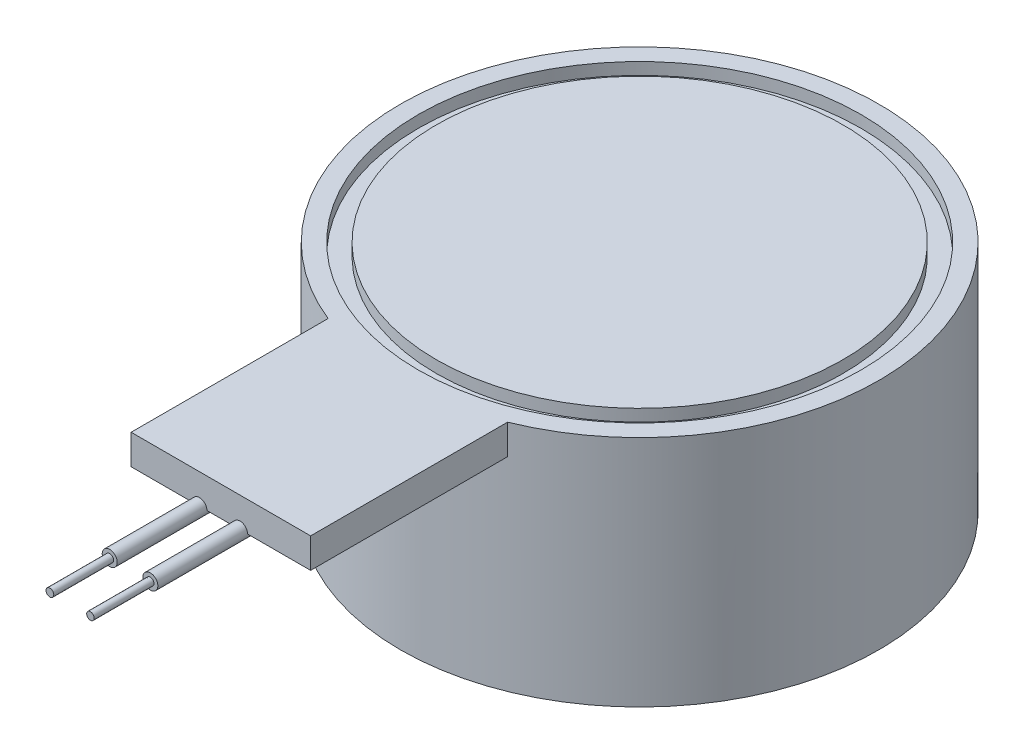
ISO-10303-21;
HEADER;
FILE_DESCRIPTION(('STEP AP214'),'2;1');
FILE_NAME('part.step','',(''),(''),'','','');
FILE_SCHEMA(('AUTOMOTIVE_DESIGN { 1 0 10303 214 1 1 1 1 }'));
ENDSEC;
DATA;
#1=APPLICATION_CONTEXT('core data for automotive mechanical design processes');
#2=APPLICATION_PROTOCOL_DEFINITION('international standard','automotive_design',2000,#1);
#3=PRODUCT_CONTEXT('',#1,'mechanical');
#4=PRODUCT('Part','Part','',(#3));
#5=PRODUCT_RELATED_PRODUCT_CATEGORY('part','',(#4));
#6=PRODUCT_DEFINITION_FORMATION('','',#4);
#7=PRODUCT_DEFINITION_CONTEXT('part definition',#1,'design');
#8=PRODUCT_DEFINITION('design','',#6,#7);
#9=PRODUCT_DEFINITION_SHAPE('','',#8);
#10=(LENGTH_UNIT() NAMED_UNIT(*) SI_UNIT(.MILLI.,.METRE.));
#11=(NAMED_UNIT(*) PLANE_ANGLE_UNIT() SI_UNIT($,.RADIAN.));
#12=(NAMED_UNIT(*) SI_UNIT($,.STERADIAN.) SOLID_ANGLE_UNIT());
#13=UNCERTAINTY_MEASURE_WITH_UNIT(LENGTH_MEASURE(1.E-05),#10,'distance_accuracy_value','');
#14=(GEOMETRIC_REPRESENTATION_CONTEXT(3) GLOBAL_UNCERTAINTY_ASSIGNED_CONTEXT((#13)) GLOBAL_UNIT_ASSIGNED_CONTEXT((#10,
#11,#12)) REPRESENTATION_CONTEXT('',''));
#15=CARTESIAN_POINT('',(0.,0.,0.));
#16=DIRECTION('',(0.,0.,1.));
#17=DIRECTION('',(1.,0.,0.));
#18=AXIS2_PLACEMENT_3D('',#15,#16,#17);
#19=CARTESIAN_POINT('',(2.01299055613309,-3.4,-4.98901514503397));
#20=DIRECTION('',(0.,1.,0.));
#21=DIRECTION('',(0.,0.,1.));
#22=AXIS2_PLACEMENT_3D('',#19,#20,#21);
#23=CYLINDRICAL_SURFACE('',#22,4.);
#24=DIRECTION('',(0.,1.,0.));
#25=VECTOR('',#24,1.);
#26=CARTESIAN_POINT('',(0.512990556133091,0.,-1.28091590148614));
#27=LINE('',#26,#25);
#28=CARTESIAN_POINT('',(0.512990556133091,0.,-1.28091590148614));
#29=VERTEX_POINT('',#28);
#30=CARTESIAN_POINT('',(0.512990556133091,0.5,-1.28091590148614));
#31=VERTEX_POINT('',#30);
#32=EDGE_CURVE('E159',#29,#31,#27,.T.);
#33=ORIENTED_EDGE('',*,*,#32,.T.);
#34=CARTESIAN_POINT('',(2.01299055613309,0.5,-4.98901514503397));
#35=DIRECTION('',(0.,1.,0.));
#36=DIRECTION('',(0.,0.,1.));
#37=AXIS2_PLACEMENT_3D('',#34,#35,#36);
#38=CIRCLE('',#37,4.);
#39=CARTESIAN_POINT('',(3.51299055613309,0.5,-1.28091590148614));
#40=VERTEX_POINT('',#39);
#41=EDGE_CURVE('E158',#40,#31,#38,.T.);
#42=ORIENTED_EDGE('',*,*,#41,.F.);
#43=DIRECTION('',(0.,1.,0.));
#44=VECTOR('',#43,1.);
#45=CARTESIAN_POINT('',(3.51299055613309,0.,-1.28091590148614));
#46=LINE('',#45,#44);
#47=CARTESIAN_POINT('',(3.51299055613309,0.,-1.28091590148614));
#48=VERTEX_POINT('',#47);
#49=EDGE_CURVE('E162',#48,#40,#46,.T.);
#50=ORIENTED_EDGE('',*,*,#49,.F.);
#51=CARTESIAN_POINT('',(2.01299055613309,0.,-4.98901514503397));
#52=DIRECTION('',(0.,1.,0.));
#53=DIRECTION('',(0.,0.,1.));
#54=AXIS2_PLACEMENT_3D('',#51,#52,#53);
#55=CIRCLE('',#54,4.);
#56=EDGE_CURVE('E143',#29,#48,#55,.T.);
#57=ORIENTED_EDGE('',*,*,#56,.F.);
#58=EDGE_LOOP('',(#33,#42,#50,#57));
#59=FACE_BOUND('',#58,.T.);
#60=CARTESIAN_POINT('',(2.01299055613309,-3.4,-4.98901514503397));
#61=DIRECTION('',(0.,1.,0.));
#62=DIRECTION('',(0.,0.,1.));
#63=AXIS2_PLACEMENT_3D('',#60,#61,#62);
#64=CIRCLE('',#63,4.);
#65=CARTESIAN_POINT('',(2.01299055613309,-3.4,-0.989015145033973));
#66=VERTEX_POINT('',#65);
#67=EDGE_CURVE('E168',#66,#66,#64,.T.);
#68=ORIENTED_EDGE('',*,*,#67,.T.);
#69=EDGE_LOOP('',(#68));
#70=FACE_BOUND('',#69,.T.);
#71=ADVANCED_FACE('F38',(#59,#70),#23,.T.);
#72=CARTESIAN_POINT('',(2.01299055613309,-3.4,-4.98901514503397));
#73=DIRECTION('',(0.,1.,0.));
#74=DIRECTION('',(0.,0.,1.));
#75=AXIS2_PLACEMENT_3D('',#72,#73,#74);
#76=PLANE('',#75);
#77=ORIENTED_EDGE('',*,*,#67,.F.);
#78=EDGE_LOOP('',(#77));
#79=FACE_BOUND('',#78,.T.);
#80=ADVANCED_FACE('F195',(#79),#76,.F.);
#81=CARTESIAN_POINT('',(2.01299055613309,0.5,-4.98901514503397));
#82=DIRECTION('',(0.,1.,0.));
#83=DIRECTION('',(0.,0.,1.));
#84=AXIS2_PLACEMENT_3D('',#81,#82,#83);
#85=PLANE('',#84);
#86=CARTESIAN_POINT('',(2.01299055613309,0.5,-4.98901514503397));
#87=DIRECTION('',(0.,1.,0.));
#88=DIRECTION('',(0.,0.,1.));
#89=AXIS2_PLACEMENT_3D('',#86,#87,#88);
#90=CIRCLE('',#89,3.7);
#91=CARTESIAN_POINT('',(2.01299055613309,0.5,-1.28901514503397));
#92=VERTEX_POINT('',#91);
#93=EDGE_CURVE('E276',#92,#92,#90,.T.);
#94=ORIENTED_EDGE('',*,*,#93,.F.);
#95=EDGE_LOOP('',(#94));
#96=FACE_BOUND('',#95,.T.);
#97=ORIENTED_EDGE('',*,*,#41,.T.);
#98=DIRECTION('',(0.,0.,1.));
#99=VECTOR('',#98,1.);
#100=CARTESIAN_POINT('',(0.512990556133091,0.5,0.));
#101=LINE('',#100,#99);
#102=CARTESIAN_POINT('',(0.512990556133091,0.5,2.01098485496603));
#103=VERTEX_POINT('',#102);
#104=EDGE_CURVE('E153',#31,#103,#101,.T.);
#105=ORIENTED_EDGE('',*,*,#104,.T.);
#106=DIRECTION('',(1.,0.,0.));
#107=VECTOR('',#106,1.);
#108=CARTESIAN_POINT('',(0.,0.5,2.01098485496603));
#109=LINE('',#108,#107);
#110=CARTESIAN_POINT('',(3.51299055613309,0.5,2.01098485496603));
#111=VERTEX_POINT('',#110);
#112=EDGE_CURVE('E134',#103,#111,#109,.T.);
#113=ORIENTED_EDGE('',*,*,#112,.T.);
#114=DIRECTION('',(0.,0.,-1.));
#115=VECTOR('',#114,1.);
#116=CARTESIAN_POINT('',(3.51299055613309,0.5,0.));
#117=LINE('',#116,#115);
#118=EDGE_CURVE('E151',#111,#40,#117,.T.);
#119=ORIENTED_EDGE('',*,*,#118,.T.);
#120=EDGE_LOOP('',(#97,#105,#113,#119));
#121=FACE_BOUND('',#120,.T.);
#122=ADVANCED_FACE('F199',(#96,#121),#85,.T.);
#123=CARTESIAN_POINT('',(0.,0.,2.01098485496603));
#124=DIRECTION('',(0.,0.,1.));
#125=DIRECTION('',(1.,0.,0.));
#126=AXIS2_PLACEMENT_3D('',#123,#124,#125);
#127=PLANE('',#126);
#128=DIRECTION('',(1.,0.,0.));
#129=VECTOR('',#128,1.);
#130=CARTESIAN_POINT('',(0.,0.,2.01098485496603));
#131=LINE('',#130,#129);
#132=CARTESIAN_POINT('',(0.512990556133091,0.,2.01098485496603));
#133=VERTEX_POINT('',#132);
#134=CARTESIAN_POINT('',(1.52973301992947,0.,2.01098485496603));
#135=VERTEX_POINT('',#134);
#136=EDGE_CURVE('E125',#133,#135,#131,.T.);
#137=ORIENTED_EDGE('',*,*,#136,.T.);
#138=CARTESIAN_POINT('',(1.65473301992947,0.,2.01098485496603));
#139=DIRECTION('',(0.,0.,1.));
#140=DIRECTION('',(1.,0.,0.));
#141=AXIS2_PLACEMENT_3D('',#138,#139,#140);
#142=CIRCLE('',#141,0.125);
#143=CARTESIAN_POINT('',(1.77973301992947,0.,2.01098485496603));
#144=VERTEX_POINT('',#143);
#145=EDGE_CURVE('E124',#144,#135,#142,.T.);
#146=ORIENTED_EDGE('',*,*,#145,.F.);
#147=CARTESIAN_POINT('',(2.20919745400809,0.,2.01098485496603));
#148=VERTEX_POINT('',#147);
#149=EDGE_CURVE('E112',#144,#148,#131,.T.);
#150=ORIENTED_EDGE('',*,*,#149,.T.);
#151=CARTESIAN_POINT('',(2.33419745400809,0.,2.01098485496603));
#152=DIRECTION('',(0.,0.,1.));
#153=DIRECTION('',(1.,0.,0.));
#154=AXIS2_PLACEMENT_3D('',#151,#152,#153);
#155=CIRCLE('',#154,0.125);
#156=CARTESIAN_POINT('',(2.45919745400809,0.,2.01098485496603));
#157=VERTEX_POINT('',#156);
#158=EDGE_CURVE('E123',#157,#148,#155,.T.);
#159=ORIENTED_EDGE('',*,*,#158,.F.);
#160=CARTESIAN_POINT('',(3.51299055613309,0.,2.01098485496603));
#161=VERTEX_POINT('',#160);
#162=EDGE_CURVE('E126',#157,#161,#131,.T.);
#163=ORIENTED_EDGE('',*,*,#162,.T.);
#164=DIRECTION('',(0.,1.,0.));
#165=VECTOR('',#164,1.);
#166=CARTESIAN_POINT('',(3.51299055613309,0.,2.01098485496603));
#167=LINE('',#166,#165);
#168=EDGE_CURVE('E148',#161,#111,#167,.T.);
#169=ORIENTED_EDGE('',*,*,#168,.T.);
#170=ORIENTED_EDGE('',*,*,#112,.F.);
#171=DIRECTION('',(0.,1.,0.));
#172=VECTOR('',#171,1.);
#173=CARTESIAN_POINT('',(0.512990556133091,0.,2.01098485496603));
#174=LINE('',#173,#172);
#175=EDGE_CURVE('E156',#133,#103,#174,.T.);
#176=ORIENTED_EDGE('',*,*,#175,.F.);
#177=EDGE_LOOP('',(#137,#146,#150,#159,#163,#169,#170,#176));
#178=FACE_BOUND('',#177,.T.);
#179=ADVANCED_FACE('F122',(#178),#127,.T.);
#180=CARTESIAN_POINT('',(0.512990556133091,0.,0.));
#181=DIRECTION('',(-1.,0.,0.));
#182=DIRECTION('',(0.,0.,1.));
#183=AXIS2_PLACEMENT_3D('',#180,#181,#182);
#184=PLANE('',#183);
#185=ORIENTED_EDGE('',*,*,#104,.F.);
#186=ORIENTED_EDGE('',*,*,#32,.F.);
#187=DIRECTION('',(0.,0.,1.));
#188=VECTOR('',#187,1.);
#189=CARTESIAN_POINT('',(0.512990556133091,0.,0.));
#190=LINE('',#189,#188);
#191=EDGE_CURVE('E145',#29,#133,#190,.T.);
#192=ORIENTED_EDGE('',*,*,#191,.T.);
#193=ORIENTED_EDGE('',*,*,#175,.T.);
#194=EDGE_LOOP('',(#185,#186,#192,#193));
#195=FACE_BOUND('',#194,.T.);
#196=ADVANCED_FACE('F207',(#195),#184,.T.);
#197=CARTESIAN_POINT('',(3.51299055613309,0.,0.));
#198=DIRECTION('',(1.,0.,0.));
#199=DIRECTION('',(0.,0.,-1.));
#200=AXIS2_PLACEMENT_3D('',#197,#198,#199);
#201=PLANE('',#200);
#202=ORIENTED_EDGE('',*,*,#118,.F.);
#203=ORIENTED_EDGE('',*,*,#168,.F.);
#204=DIRECTION('',(0.,0.,-1.));
#205=VECTOR('',#204,1.);
#206=CARTESIAN_POINT('',(3.51299055613309,0.,0.));
#207=LINE('',#206,#205);
#208=EDGE_CURVE('E140',#161,#48,#207,.T.);
#209=ORIENTED_EDGE('',*,*,#208,.T.);
#210=ORIENTED_EDGE('',*,*,#49,.T.);
#211=EDGE_LOOP('',(#202,#203,#209,#210));
#212=FACE_BOUND('',#211,.T.);
#213=ADVANCED_FACE('F208',(#212),#201,.T.);
#214=CARTESIAN_POINT('',(0.,0.,0.));
#215=DIRECTION('',(0.,1.,0.));
#216=DIRECTION('',(0.,0.,1.));
#217=AXIS2_PLACEMENT_3D('',#214,#215,#216);
#218=PLANE('',#217);
#219=ORIENTED_EDGE('',*,*,#162,.F.);
#220=DIRECTION('',(0.,0.,-1.));
#221=VECTOR('',#220,1.);
#222=CARTESIAN_POINT('',(2.45919745400809,0.,2.01098485496603));
#223=LINE('',#222,#221);
#224=CARTESIAN_POINT('',(2.45919745400809,0.,1.01098485496603));
#225=VERTEX_POINT('',#224);
#226=EDGE_CURVE('E129',#157,#225,#223,.T.);
#227=ORIENTED_EDGE('',*,*,#226,.T.);
#228=DIRECTION('',(1.,0.,0.));
#229=VECTOR('',#228,1.);
#230=CARTESIAN_POINT('',(2.20919745400809,0.,1.01098485496603));
#231=LINE('',#230,#229);
#232=CARTESIAN_POINT('',(2.20919745400809,0.,1.01098485496603));
#233=VERTEX_POINT('',#232);
#234=EDGE_CURVE('E115',#225,#233,#231,.F.);
#235=ORIENTED_EDGE('',*,*,#234,.T.);
#236=DIRECTION('',(0.,0.,-1.));
#237=VECTOR('',#236,1.);
#238=CARTESIAN_POINT('',(2.20919745400809,0.,1.01098485496603));
#239=LINE('',#238,#237);
#240=EDGE_CURVE('E108',#233,#148,#239,.F.);
#241=ORIENTED_EDGE('',*,*,#240,.T.);
#242=ORIENTED_EDGE('',*,*,#149,.F.);
#243=DIRECTION('',(0.,0.,-1.));
#244=VECTOR('',#243,1.);
#245=CARTESIAN_POINT('',(1.77973301992947,0.,2.01098485496603));
#246=LINE('',#245,#244);
#247=CARTESIAN_POINT('',(1.77973301992947,0.,1.01098485496603));
#248=VERTEX_POINT('',#247);
#249=EDGE_CURVE('E60',#144,#248,#246,.T.);
#250=ORIENTED_EDGE('',*,*,#249,.T.);
#251=DIRECTION('',(1.,0.,0.));
#252=VECTOR('',#251,1.);
#253=CARTESIAN_POINT('',(1.52973301992947,0.,1.01098485496603));
#254=LINE('',#253,#252);
#255=CARTESIAN_POINT('',(1.52973301992947,0.,1.01098485496603));
#256=VERTEX_POINT('',#255);
#257=EDGE_CURVE('E174',#248,#256,#254,.F.);
#258=ORIENTED_EDGE('',*,*,#257,.T.);
#259=DIRECTION('',(0.,0.,-1.));
#260=VECTOR('',#259,1.);
#261=CARTESIAN_POINT('',(1.52973301992947,0.,1.01098485496603));
#262=LINE('',#261,#260);
#263=EDGE_CURVE('E172',#256,#135,#262,.F.);
#264=ORIENTED_EDGE('',*,*,#263,.T.);
#265=ORIENTED_EDGE('',*,*,#136,.F.);
#266=ORIENTED_EDGE('',*,*,#191,.F.);
#267=ORIENTED_EDGE('',*,*,#56,.T.);
#268=ORIENTED_EDGE('',*,*,#208,.F.);
#269=EDGE_LOOP('',(#219,#227,#235,#241,#242,#250,#258,#264,#265,#266,#267,#268));
#270=FACE_BOUND('',#269,.T.);
#271=ADVANCED_FACE('F111',(#270),#218,.F.);
#272=CARTESIAN_POINT('',(2.33419745400809,0.,3.51098485496603));
#273=DIRECTION('',(0.,0.,-1.));
#274=DIRECTION('',(-1.,0.,0.));
#275=AXIS2_PLACEMENT_3D('',#272,#273,#274);
#276=CYLINDRICAL_SURFACE('',#275,0.125);
#277=CARTESIAN_POINT('',(2.33419745400809,0.,3.51098485496603));
#278=DIRECTION('',(0.,0.,1.));
#279=DIRECTION('',(1.,0.,0.));
#280=AXIS2_PLACEMENT_3D('',#277,#278,#279);
#281=CIRCLE('',#280,0.125);
#282=CARTESIAN_POINT('',(2.45919745400809,0.,3.51098485496603));
#283=VERTEX_POINT('',#282);
#284=EDGE_CURVE('E130',#283,#283,#281,.T.);
#285=ORIENTED_EDGE('',*,*,#284,.F.);
#286=EDGE_LOOP('',(#285));
#287=FACE_BOUND('',#286,.T.);
#288=ORIENTED_EDGE('',*,*,#158,.T.);
#289=ORIENTED_EDGE('',*,*,#240,.F.);
#290=CARTESIAN_POINT('',(2.20919745400809,0.,1.01098485496603));
#291=CARTESIAN_POINT('',(2.20922047159713,1.05677938636474E-06,1.03207451036155));
#292=CARTESIAN_POINT('',(2.20919830858982,-0.000667104168060805,1.05316473019002));
#293=CARTESIAN_POINT('',(2.20922864638061,-0.00333625097628836,1.0952857805346));
#294=CARTESIAN_POINT('',(2.20928123622298,-0.00533882485560418,1.11631651027251));
#295=CARTESIAN_POINT('',(2.20962614845193,-0.010660525433978,1.15812384622042));
#296=CARTESIAN_POINT('',(2.20991751404545,-0.0139743704078802,1.17890113136451));
#297=CARTESIAN_POINT('',(2.21106481197055,-0.0219006059370929,1.22017982520286));
#298=CARTESIAN_POINT('',(2.21192030179405,-0.0265119770680325,1.24068143728792));
#299=CARTESIAN_POINT('',(2.21424688566159,-0.0353645746462061,1.27496827356824));
#300=CARTESIAN_POINT('',(2.21544346429201,-0.0392742058334292,1.28885768092329));
#301=CARTESIAN_POINT('',(2.21856053474751,-0.0476792431083009,1.31642403251362));
#302=CARTESIAN_POINT('',(2.22048302383371,-0.0521762427401654,1.33010028116868));
#303=CARTESIAN_POINT('',(2.22577279394166,-0.0625197349630622,1.35942839433894));
#304=CARTESIAN_POINT('',(2.22933276738598,-0.0684650239036678,1.37501172568305));
#305=CARTESIAN_POINT('',(2.23857400806439,-0.0808818807742391,1.40530036593214));
#306=CARTESIAN_POINT('',(2.24424369897393,-0.0873504286400888,1.42000996750761));
#307=CARTESIAN_POINT('',(2.254083635066,-0.0960075759677494,1.43856597740523));
#308=CARTESIAN_POINT('',(2.25678030553065,-0.098207870388598,1.44318388529278));
#309=CARTESIAN_POINT('',(2.26264363889719,-0.102559787018418,1.45214885163244));
#310=CARTESIAN_POINT('',(2.26581077160948,-0.104711358067553,1.45649563310107));
#311=CARTESIAN_POINT('',(2.27271865148373,-0.108912041713478,1.46483976675242));
#312=CARTESIAN_POINT('',(2.27646393481595,-0.110960157445325,1.46883392459853));
#313=CARTESIAN_POINT('',(2.28458808949557,-0.114821829511777,1.47625573567426));
#314=CARTESIAN_POINT('',(2.28896565411916,-0.11663585534228,1.47968452677923));
#315=CARTESIAN_POINT('',(2.29688713615746,-0.119350033710189,1.4847581698948));
#316=CARTESIAN_POINT('',(2.30025212140744,-0.120357189154922,1.4866233045801));
#317=CARTESIAN_POINT('',(2.30727298793179,-0.122119340970012,1.4898678838206));
#318=CARTESIAN_POINT('',(2.31092865876034,-0.122874517742287,1.49124767589109));
#319=CARTESIAN_POINT('',(2.31850317928215,-0.124070577488831,1.49342577964829));
#320=CARTESIAN_POINT('',(2.32242428681203,-0.124508256525395,1.49421816539656));
#321=CARTESIAN_POINT('',(2.3303668259289,-0.125004311870624,1.49511587818014));
#322=CARTESIAN_POINT('',(2.33438811165919,-0.125063210586761,1.495222151491));
#323=CARTESIAN_POINT('',(2.34085315889939,-0.124847479423344,1.49483199196038));
#324=CARTESIAN_POINT('',(2.34331647484581,-0.124690935049954,1.49454896977158));
#325=CARTESIAN_POINT('',(2.34818629055596,-0.124238828000402,1.49372971007708));
#326=CARTESIAN_POINT('',(2.35059281142331,-0.123943317842546,1.49319356823071));
#327=CARTESIAN_POINT('',(2.35726725380764,-0.122929761910802,1.49134893475308));
#328=CARTESIAN_POINT('',(2.36143947204051,-0.122064055102238,1.48976781985834));
#329=CARTESIAN_POINT('',(2.3694075068979,-0.120009776433073,1.48598152235089));
#330=CARTESIAN_POINT('',(2.37320198677907,-0.118820109990974,1.48377422293571));
#331=CARTESIAN_POINT('',(2.38178661566729,-0.115708718140307,1.47793620137682));
#332=CARTESIAN_POINT('',(2.38638790592702,-0.113682440924704,1.47408607906262));
#333=CARTESIAN_POINT('',(2.39486721759296,-0.109392820252355,1.46578257632829));
#334=CARTESIAN_POINT('',(2.39874405118975,-0.107129096805192,1.4613282255026));
#335=CARTESIAN_POINT('',(2.40864179615153,-0.100699361251585,1.44841201951622));
#336=CARTESIAN_POINT('',(2.41400645643187,-0.0964143184986088,1.43951180138203));
#337=CARTESIAN_POINT('',(2.42332872829781,-0.0878658527438373,1.42100517062963));
#338=CARTESIAN_POINT('',(2.42728242610859,-0.0836025217222031,1.41139688153654));
#339=CARTESIAN_POINT('',(2.43437657182455,-0.074982217613368,1.39107928813943));
#340=CARTESIAN_POINT('',(2.43744406085412,-0.0706383665495276,1.38033945043643));
#341=CARTESIAN_POINT('',(2.44269980720996,-0.0622615116732687,1.35852434975466));
#342=CARTESIAN_POINT('',(2.44488708439195,-0.0582288584044237,1.34744872753954));
#343=CARTESIAN_POINT('',(2.45049029751926,-0.0466452106347632,1.31376966551478));
#344=CARTESIAN_POINT('',(2.45291880600256,-0.0396502398834233,1.29081162158263));
#345=CARTESIAN_POINT('',(2.4561812524689,-0.0278890639813842,1.24652217967117));
#346=CARTESIAN_POINT('',(2.45714147188329,-0.0229769064423686,1.22523575499471));
#347=CARTESIAN_POINT('',(2.45842082833224,-0.0145501542754275,1.18235029564982));
#348=CARTESIAN_POINT('',(2.45873942646979,-0.0110367364326502,1.16075101353349));
#349=CARTESIAN_POINT('',(2.45910844511986,-0.00549224016009295,1.11781740894001));
#350=CARTESIAN_POINT('',(2.45916427600883,-0.00343200575597569,1.09648684606192));
#351=CARTESIAN_POINT('',(2.4591967162729,-0.000686365736022313,1.05376585069065));
#352=CARTESIAN_POINT('',(2.45917343123939,8.70394958819836E-07,1.03237553603609));
#353=CARTESIAN_POINT('',(2.4591974540081,0.,1.01098485496603));
#354=B_SPLINE_CURVE_WITH_KNOTS('',3,(#290,#291,#292,#293,#294,#295,#296,#297,#298,#299,#300,
#301,#302,#303,#304,#305,#306,#307,#308,#309,#310,#311,#312,#313,#314,#315,#316,#317,#318,#319,
#320,#321,#322,#323,#324,#325,#326,#327,#328,#329,#330,#331,#332,#333,#334,#335,#336,#337,#338,
#339,#340,#341,#342,#343,#344,#345,#346,#347,#348,#349,#350,#351,#352,#353),.UNSPECIFIED.,.F.,
.F.,(4,2,2,2,2,2,2,2,2,2,2,2,2,2,2,2,2,2,2,2,2,2,2,2,2,2,2,2,2,2,2,4),(0.,0.0632595075540552,
0.12659443187453,0.189676802026779,0.252709748127612,0.29612195020278,0.339654476875341,
0.390733868540527,0.441537016916982,0.458865395111421,0.476211195477037,0.493700744755844,
0.511154652607943,0.523046110211037,0.534929035870163,0.546930267001542,0.558914942679923,
0.566351682410609,0.573785613885437,0.587329268034682,0.600919263217855,0.619809559371044,
0.638730561141066,0.672263245717404,0.705888234359086,0.741784169505824,0.777719966060271,
0.849918577906799,0.915466370119843,0.981069192930568,1.04531516526833,1.10947542597947),.UNSPECIFIED.);
#355=EDGE_CURVE('E53',#233,#225,#354,.T.);
#356=ORIENTED_EDGE('',*,*,#355,.T.);
#357=ORIENTED_EDGE('',*,*,#226,.F.);
#358=EDGE_LOOP('',(#288,#289,#356,#357));
#359=FACE_BOUND('',#358,.T.);
#360=ADVANCED_FACE('F128',(#287,#359),#276,.T.);
#361=CARTESIAN_POINT('',(2.33419745400809,0.,3.51098485496603));
#362=DIRECTION('',(0.,0.,1.));
#363=DIRECTION('',(1.,0.,0.));
#364=AXIS2_PLACEMENT_3D('',#361,#362,#363);
#365=PLANE('',#364);
#366=CARTESIAN_POINT('',(2.33215033419962,0.,3.51098485496603));
#367=DIRECTION('',(0.,0.,1.));
#368=DIRECTION('',(1.,0.,0.));
#369=AXIS2_PLACEMENT_3D('',#366,#367,#368);
#370=CIRCLE('',#369,0.0624999999999999);
#371=CARTESIAN_POINT('',(2.39465033419962,0.,3.51098485496603));
#372=VERTEX_POINT('',#371);
#373=EDGE_CURVE('E171',#372,#372,#370,.T.);
#374=ORIENTED_EDGE('',*,*,#373,.F.);
#375=EDGE_LOOP('',(#374));
#376=FACE_BOUND('',#375,.T.);
#377=ORIENTED_EDGE('',*,*,#284,.T.);
#378=EDGE_LOOP('',(#377));
#379=FACE_BOUND('',#378,.T.);
#380=ADVANCED_FACE('F218',(#376,#379),#365,.T.);
#381=CARTESIAN_POINT('',(1.65473301992947,0.,3.51098485496603));
#382=DIRECTION('',(0.,0.,-1.));
#383=DIRECTION('',(-1.,0.,0.));
#384=AXIS2_PLACEMENT_3D('',#381,#382,#383);
#385=CYLINDRICAL_SURFACE('',#384,0.125);
#386=CARTESIAN_POINT('',(1.65473301992947,0.,3.51098485496603));
#387=DIRECTION('',(0.,0.,1.));
#388=DIRECTION('',(1.,0.,0.));
#389=AXIS2_PLACEMENT_3D('',#386,#387,#388);
#390=CIRCLE('',#389,0.125);
#391=CARTESIAN_POINT('',(1.77973301992947,0.,3.51098485496603));
#392=VERTEX_POINT('',#391);
#393=EDGE_CURVE('E131',#392,#392,#390,.T.);
#394=ORIENTED_EDGE('',*,*,#393,.F.);
#395=EDGE_LOOP('',(#394));
#396=FACE_BOUND('',#395,.T.);
#397=ORIENTED_EDGE('',*,*,#145,.T.);
#398=ORIENTED_EDGE('',*,*,#263,.F.);
#399=CARTESIAN_POINT('',(1.52973301992947,0.,1.01098485496603));
#400=CARTESIAN_POINT('',(1.52975603751851,1.05677938624242E-06,1.03207451036155));
#401=CARTESIAN_POINT('',(1.52973387451119,-0.000667104168060911,1.05316473019002));
#402=CARTESIAN_POINT('',(1.52976421230199,-0.00333625097628838,1.0952857805346));
#403=CARTESIAN_POINT('',(1.52981680214436,-0.00533882485560413,1.11631651027251));
#404=CARTESIAN_POINT('',(1.5301617143733,-0.010660525433978,1.15812384622042));
#405=CARTESIAN_POINT('',(1.53045307996682,-0.0139743704078803,1.17890113136451));
#406=CARTESIAN_POINT('',(1.53160037789192,-0.021900605937093,1.22017982520286));
#407=CARTESIAN_POINT('',(1.53245586771542,-0.0265119770680326,1.24068143728792));
#408=CARTESIAN_POINT('',(1.53478245158297,-0.0353645746462062,1.27496827356824));
#409=CARTESIAN_POINT('',(1.53597903021338,-0.0392742058334293,1.28885768092329));
#410=CARTESIAN_POINT('',(1.53909610066888,-0.0476792431083012,1.31642403251362));
#411=CARTESIAN_POINT('',(1.54101858975509,-0.0521762427401658,1.33010028116868));
#412=CARTESIAN_POINT('',(1.54630835986304,-0.0625197349630629,1.35942839433894));
#413=CARTESIAN_POINT('',(1.54986833330735,-0.0684650239036685,1.37501172568306));
#414=CARTESIAN_POINT('',(1.55910957398576,-0.08088188077424,1.40530036593214));
#415=CARTESIAN_POINT('',(1.5647792648953,-0.0873504286400899,1.42000996750761));
#416=CARTESIAN_POINT('',(1.57461920098737,-0.0960075759677503,1.43856597740523));
#417=CARTESIAN_POINT('',(1.57731587145203,-0.0982078703885988,1.44318388529278));
#418=CARTESIAN_POINT('',(1.58317920481856,-0.102559787018419,1.45214885163244));
#419=CARTESIAN_POINT('',(1.58634633753085,-0.104711358067554,1.45649563310108));
#420=CARTESIAN_POINT('',(1.59325421740511,-0.108912041713479,1.46483976675243));
#421=CARTESIAN_POINT('',(1.59699950073732,-0.110960157445325,1.46883392459853));
#422=CARTESIAN_POINT('',(1.60512365541694,-0.114821829511778,1.47625573567426));
#423=CARTESIAN_POINT('',(1.60950122004054,-0.11663585534228,1.47968452677923));
#424=CARTESIAN_POINT('',(1.61742270207884,-0.119350033710189,1.48475816989481));
#425=CARTESIAN_POINT('',(1.62078768732882,-0.120357189154922,1.4866233045801));
#426=CARTESIAN_POINT('',(1.62780855385316,-0.122119340970012,1.4898678838206));
#427=CARTESIAN_POINT('',(1.63146422468172,-0.122874517742287,1.49124767589109));
#428=CARTESIAN_POINT('',(1.63903874520353,-0.124070577488831,1.49342577964829));
#429=CARTESIAN_POINT('',(1.6429598527334,-0.124508256525395,1.49421816539656));
#430=CARTESIAN_POINT('',(1.65090239185028,-0.125004311870624,1.49511587818014));
#431=CARTESIAN_POINT('',(1.65492367758056,-0.125063210586761,1.49522215149101));
#432=CARTESIAN_POINT('',(1.66138872482077,-0.124847479423344,1.49483199196038));
#433=CARTESIAN_POINT('',(1.66385204076719,-0.124690935049954,1.49454896977157));
#434=CARTESIAN_POINT('',(1.66872185647734,-0.124238828000401,1.49372971007707));
#435=CARTESIAN_POINT('',(1.6711283773447,-0.123943317842544,1.49319356823071));
#436=CARTESIAN_POINT('',(1.67780281972903,-0.1229297619108,1.49134893475307));
#437=CARTESIAN_POINT('',(1.6819750379619,-0.122064055102235,1.48976781985833));
#438=CARTESIAN_POINT('',(1.68994307281929,-0.120009776433069,1.48598152235088));
#439=CARTESIAN_POINT('',(1.69373755270045,-0.118820109990969,1.4837742229357));
#440=CARTESIAN_POINT('',(1.70232218158869,-0.1157087181403,1.47793620137681));
#441=CARTESIAN_POINT('',(1.70692347184842,-0.113682440924697,1.47408607906261));
#442=CARTESIAN_POINT('',(1.71540278351435,-0.109392820252346,1.46578257632828));
#443=CARTESIAN_POINT('',(1.71927961711114,-0.107129096805182,1.46132822550258));
#444=CARTESIAN_POINT('',(1.72917736207292,-0.100699361251572,1.44841201951619));
#445=CARTESIAN_POINT('',(1.73454202235326,-0.096414318498594,1.439511801382));
#446=CARTESIAN_POINT('',(1.7438642942192,-0.087865852743819,1.42100517062959));
#447=CARTESIAN_POINT('',(1.74781799202998,-0.0836025217221831,1.4113968815365));
#448=CARTESIAN_POINT('',(1.75491213774594,-0.0749822176133446,1.39107928813937));
#449=CARTESIAN_POINT('',(1.75797962677551,-0.0706383665495024,1.38033945043636));
#450=CARTESIAN_POINT('',(1.76323537313135,-0.0622615116732404,1.35852434975459));
#451=CARTESIAN_POINT('',(1.76542265031334,-0.0582288584043941,1.34744872753946));
#452=CARTESIAN_POINT('',(1.77102586344065,-0.0466452106347305,1.31376966551468));
#453=CARTESIAN_POINT('',(1.77345437192395,-0.0396502398833897,1.29081162158251));
#454=CARTESIAN_POINT('',(1.77671681839028,-0.0278890639813562,1.24652217967105));
#455=CARTESIAN_POINT('',(1.77767703780467,-0.0229769064423455,1.22523575499461));
#456=CARTESIAN_POINT('',(1.77895639425362,-0.0145501542754129,1.18235029564973));
#457=CARTESIAN_POINT('',(1.77927499239116,-0.0110367364326391,1.16075101353341));
#458=CARTESIAN_POINT('',(1.77964401104124,-0.00549224016008737,1.11781740893996));
#459=CARTESIAN_POINT('',(1.7796998419302,-0.00343200575597224,1.09648684606188));
#460=CARTESIAN_POINT('',(1.77973228219428,-0.000686365736021725,1.05376585069063));
#461=CARTESIAN_POINT('',(1.77970899716077,8.70394958684754E-07,1.03237553603608));
#462=CARTESIAN_POINT('',(1.77973301992947,0.,1.01098485496603));
#463=B_SPLINE_CURVE_WITH_KNOTS('',3,(#399,#400,#401,#402,#403,#404,#405,#406,#407,#408,#409,
#410,#411,#412,#413,#414,#415,#416,#417,#418,#419,#420,#421,#422,#423,#424,#425,#426,#427,#428,
#429,#430,#431,#432,#433,#434,#435,#436,#437,#438,#439,#440,#441,#442,#443,#444,#445,#446,#447,
#448,#449,#450,#451,#452,#453,#454,#455,#456,#457,#458,#459,#460,#461,#462),.UNSPECIFIED.,.F.,
.F.,(4,2,2,2,2,2,2,2,2,2,2,2,2,2,2,2,2,2,2,2,2,2,2,2,2,2,2,2,2,2,2,4),(0.,0.0632595075540552,
0.12659443187453,0.189676802026779,0.252709748127612,0.296121950202781,0.339654476875344,
0.390733868540529,0.441537016916984,0.458865395111423,0.476211195477038,0.493700744755846,
0.511154652607944,0.523046110211038,0.534929035870164,0.546930267001543,0.558914942679924,
0.566351682410617,0.57378561388545,0.587329268034698,0.600919263217873,0.619809559371068,
0.638730561141096,0.672263245717448,0.705888234359143,0.741784169505901,0.777719966060366,
0.849918577906932,0.915466370119941,0.981069192930631,1.04531516526836,1.10947542597947),.UNSPECIFIED.);
#464=EDGE_CURVE('E11',#256,#248,#463,.T.);
#465=ORIENTED_EDGE('',*,*,#464,.T.);
#466=ORIENTED_EDGE('',*,*,#249,.F.);
#467=EDGE_LOOP('',(#397,#398,#465,#466));
#468=FACE_BOUND('',#467,.T.);
#469=ADVANCED_FACE('F223',(#396,#468),#385,.T.);
#470=CARTESIAN_POINT('',(1.65473301992947,0.,3.51098485496603));
#471=DIRECTION('',(0.,0.,1.));
#472=DIRECTION('',(1.,0.,0.));
#473=AXIS2_PLACEMENT_3D('',#470,#471,#472);
#474=PLANE('',#473);
#475=CARTESIAN_POINT('',(1.65473301992947,0.,3.51098485496603));
#476=DIRECTION('',(0.,0.,1.));
#477=DIRECTION('',(1.,0.,0.));
#478=AXIS2_PLACEMENT_3D('',#475,#476,#477);
#479=CIRCLE('',#478,0.0649999999999999);
#480=CARTESIAN_POINT('',(1.71973301992947,0.,3.51098485496603));
#481=VERTEX_POINT('',#480);
#482=EDGE_CURVE('E175',#481,#481,#479,.T.);
#483=ORIENTED_EDGE('',*,*,#482,.F.);
#484=EDGE_LOOP('',(#483));
#485=FACE_BOUND('',#484,.T.);
#486=ORIENTED_EDGE('',*,*,#393,.T.);
#487=EDGE_LOOP('',(#486));
#488=FACE_BOUND('',#487,.T.);
#489=ADVANCED_FACE('F230',(#485,#488),#474,.T.);
#490=CARTESIAN_POINT('',(2.33215033419962,0.,4.51098485496603));
#491=DIRECTION('',(0.,0.,-1.));
#492=DIRECTION('',(-1.,0.,0.));
#493=AXIS2_PLACEMENT_3D('',#490,#491,#492);
#494=CYLINDRICAL_SURFACE('',#493,0.0624999999999999);
#495=CARTESIAN_POINT('',(2.33215033419962,0.,4.51098485496603));
#496=DIRECTION('',(0.,0.,1.));
#497=DIRECTION('',(1.,0.,0.));
#498=AXIS2_PLACEMENT_3D('',#495,#496,#497);
#499=CIRCLE('',#498,0.0624999999999999);
#500=CARTESIAN_POINT('',(2.39465033419962,0.,4.51098485496603));
#501=VERTEX_POINT('',#500);
#502=EDGE_CURVE('E287',#501,#501,#499,.T.);
#503=ORIENTED_EDGE('',*,*,#502,.F.);
#504=EDGE_LOOP('',(#503));
#505=FACE_BOUND('',#504,.T.);
#506=ORIENTED_EDGE('',*,*,#373,.T.);
#507=EDGE_LOOP('',(#506));
#508=FACE_BOUND('',#507,.T.);
#509=ADVANCED_FACE('F237',(#505,#508),#494,.T.);
#510=CARTESIAN_POINT('',(2.33215033419962,0.,4.51098485496603));
#511=DIRECTION('',(0.,0.,1.));
#512=DIRECTION('',(1.,0.,0.));
#513=AXIS2_PLACEMENT_3D('',#510,#511,#512);
#514=PLANE('',#513);
#515=ORIENTED_EDGE('',*,*,#502,.T.);
#516=EDGE_LOOP('',(#515));
#517=FACE_BOUND('',#516,.T.);
#518=ADVANCED_FACE('F241',(#517),#514,.T.);
#519=CARTESIAN_POINT('',(1.65473301992947,0.,4.51098485496603));
#520=DIRECTION('',(0.,0.,-1.));
#521=DIRECTION('',(-1.,0.,0.));
#522=AXIS2_PLACEMENT_3D('',#519,#520,#521);
#523=CYLINDRICAL_SURFACE('',#522,0.0649999999999999);
#524=CARTESIAN_POINT('',(1.65473301992947,0.,4.51098485496603));
#525=DIRECTION('',(0.,0.,1.));
#526=DIRECTION('',(1.,0.,0.));
#527=AXIS2_PLACEMENT_3D('',#524,#525,#526);
#528=CIRCLE('',#527,0.0649999999999999);
#529=CARTESIAN_POINT('',(1.71973301992947,0.,4.51098485496603));
#530=VERTEX_POINT('',#529);
#531=EDGE_CURVE('E282',#530,#530,#528,.T.);
#532=ORIENTED_EDGE('',*,*,#531,.F.);
#533=EDGE_LOOP('',(#532));
#534=FACE_BOUND('',#533,.T.);
#535=ORIENTED_EDGE('',*,*,#482,.T.);
#536=EDGE_LOOP('',(#535));
#537=FACE_BOUND('',#536,.T.);
#538=ADVANCED_FACE('F245',(#534,#537),#523,.T.);
#539=CARTESIAN_POINT('',(1.65473301992947,0.,4.51098485496603));
#540=DIRECTION('',(0.,0.,1.));
#541=DIRECTION('',(1.,0.,0.));
#542=AXIS2_PLACEMENT_3D('',#539,#540,#541);
#543=PLANE('',#542);
#544=ORIENTED_EDGE('',*,*,#531,.T.);
#545=EDGE_LOOP('',(#544));
#546=FACE_BOUND('',#545,.T.);
#547=ADVANCED_FACE('F192',(#546),#543,.T.);
#548=CARTESIAN_POINT('',(2.33419745400809,-1.,1.01098485496603));
#549=DIRECTION('',(-1.,0.,0.));
#550=DIRECTION('',(0.,0.,1.));
#551=AXIS2_PLACEMENT_3D('',#548,#549,#550);
#552=CYLINDRICAL_SURFACE('',#551,1.);
#553=ORIENTED_EDGE('',*,*,#355,.F.);
#554=ORIENTED_EDGE('',*,*,#234,.F.);
#555=EDGE_LOOP('',(#553,#554));
#556=FACE_BOUND('',#555,.T.);
#557=ADVANCED_FACE('F188',(#556),#552,.F.);
#558=CARTESIAN_POINT('',(1.65473301992947,-1.,1.01098485496603));
#559=DIRECTION('',(-1.,0.,0.));
#560=DIRECTION('',(0.,0.,1.));
#561=AXIS2_PLACEMENT_3D('',#558,#559,#560);
#562=CYLINDRICAL_SURFACE('',#561,1.);
#563=ORIENTED_EDGE('',*,*,#464,.F.);
#564=ORIENTED_EDGE('',*,*,#257,.F.);
#565=EDGE_LOOP('',(#563,#564));
#566=FACE_BOUND('',#565,.T.);
#567=ADVANCED_FACE('F40',(#566),#562,.F.);
#568=CARTESIAN_POINT('',(2.01299055613309,0.3,-4.98901514503397));
#569=DIRECTION('',(0.,1.,0.));
#570=DIRECTION('',(0.,0.,1.));
#571=AXIS2_PLACEMENT_3D('',#568,#569,#570);
#572=CYLINDRICAL_SURFACE('',#571,3.7);
#573=CARTESIAN_POINT('',(2.01299055613309,0.3,-4.98901514503397));
#574=DIRECTION('',(0.,1.,0.));
#575=DIRECTION('',(0.,0.,1.));
#576=AXIS2_PLACEMENT_3D('',#573,#574,#575);
#577=CIRCLE('',#576,3.7);
#578=CARTESIAN_POINT('',(2.01299055613309,0.3,-1.28901514503397));
#579=VERTEX_POINT('',#578);
#580=EDGE_CURVE('E279',#579,#579,#577,.T.);
#581=ORIENTED_EDGE('',*,*,#580,.F.);
#582=EDGE_LOOP('',(#581));
#583=FACE_BOUND('',#582,.T.);
#584=ORIENTED_EDGE('',*,*,#93,.T.);
#585=EDGE_LOOP('',(#584));
#586=FACE_BOUND('',#585,.T.);
#587=ADVANCED_FACE('F253',(#583,#586),#572,.F.);
#588=CARTESIAN_POINT('',(2.01299055613309,0.3,-4.98901514503397));
#589=DIRECTION('',(0.,1.,0.));
#590=DIRECTION('',(0.,0.,1.));
#591=AXIS2_PLACEMENT_3D('',#588,#589,#590);
#592=PLANE('',#591);
#593=CARTESIAN_POINT('',(2.01299055613309,0.3,-4.98901514503397));
#594=DIRECTION('',(0.,1.,0.));
#595=DIRECTION('',(0.,0.,1.));
#596=AXIS2_PLACEMENT_3D('',#593,#594,#595);
#597=CIRCLE('',#596,3.4);
#598=CARTESIAN_POINT('',(2.01299055613309,0.3,-1.58901514503397));
#599=VERTEX_POINT('',#598);
#600=EDGE_CURVE('E271',#599,#599,#597,.T.);
#601=ORIENTED_EDGE('',*,*,#600,.F.);
#602=EDGE_LOOP('',(#601));
#603=FACE_BOUND('',#602,.T.);
#604=ORIENTED_EDGE('',*,*,#580,.T.);
#605=EDGE_LOOP('',(#604));
#606=FACE_BOUND('',#605,.T.);
#607=ADVANCED_FACE('F256',(#603,#606),#592,.T.);
#608=CARTESIAN_POINT('',(2.01299055613309,0.3,-4.98901514503397));
#609=DIRECTION('',(0.,1.,0.));
#610=DIRECTION('',(0.,0.,1.));
#611=AXIS2_PLACEMENT_3D('',#608,#609,#610);
#612=CYLINDRICAL_SURFACE('',#611,3.4);
#613=ORIENTED_EDGE('',*,*,#600,.T.);
#614=EDGE_LOOP('',(#613));
#615=FACE_BOUND('',#614,.T.);
#616=CARTESIAN_POINT('',(2.01299055613309,0.5,-4.98901514503397));
#617=DIRECTION('',(0.,1.,0.));
#618=DIRECTION('',(0.,0.,1.));
#619=AXIS2_PLACEMENT_3D('',#616,#617,#618);
#620=CIRCLE('',#619,3.4);
#621=CARTESIAN_POINT('',(2.01299055613309,0.5,-1.58901514503397));
#622=VERTEX_POINT('',#621);
#623=EDGE_CURVE('E274',#622,#622,#620,.T.);
#624=ORIENTED_EDGE('',*,*,#623,.F.);
#625=EDGE_LOOP('',(#624));
#626=FACE_BOUND('',#625,.T.);
#627=ADVANCED_FACE('F260',(#615,#626),#612,.T.);
#628=ORIENTED_EDGE('',*,*,#623,.T.);
#629=EDGE_LOOP('',(#628));
#630=FACE_BOUND('',#629,.T.);
#631=ADVANCED_FACE('F204',(#630),#85,.T.);
#632=CLOSED_SHELL('',(#71,#80,#122,#179,#196,#213,#271,#360,#380,#469,#489,#509,#518,#538,#547,
#557,#567,#587,#607,#627,#631));
#633=MANIFOLD_SOLID_BREP('B2',#632);
#634=ADVANCED_BREP_SHAPE_REPRESENTATION('',(#18,#633),#14);
#635=SHAPE_DEFINITION_REPRESENTATION(#9,#634);
ENDSEC;
END-ISO-10303-21;
